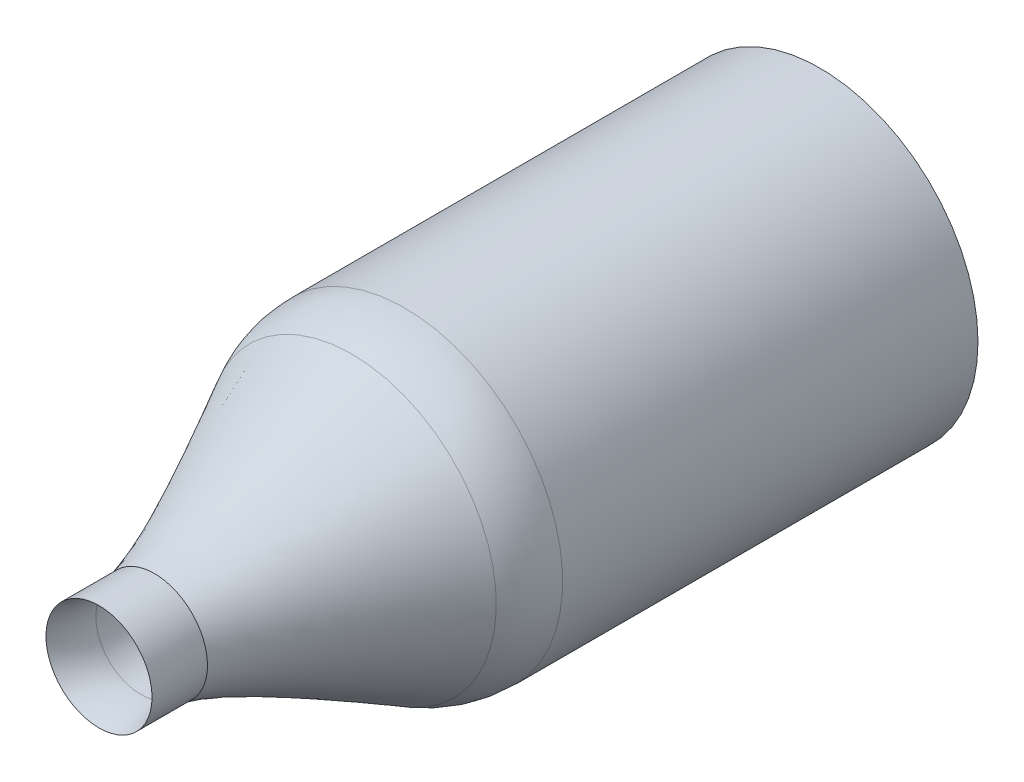
ISO-10303-21;
HEADER;
FILE_DESCRIPTION(('STEP AP214'),'2;1');
FILE_NAME('part.step','',(''),(''),'','','');
FILE_SCHEMA(('AUTOMOTIVE_DESIGN { 1 0 10303 214 1 1 1 1 }'));
ENDSEC;
DATA;
#1=APPLICATION_CONTEXT('core data for automotive mechanical design processes');
#2=APPLICATION_PROTOCOL_DEFINITION('international standard','automotive_design',2000,#1);
#3=PRODUCT_CONTEXT('',#1,'mechanical');
#4=PRODUCT('Part','Part','',(#3));
#5=PRODUCT_RELATED_PRODUCT_CATEGORY('part','',(#4));
#6=PRODUCT_DEFINITION_FORMATION('','',#4);
#7=PRODUCT_DEFINITION_CONTEXT('part definition',#1,'design');
#8=PRODUCT_DEFINITION('design','',#6,#7);
#9=PRODUCT_DEFINITION_SHAPE('','',#8);
#10=(LENGTH_UNIT() NAMED_UNIT(*) SI_UNIT(.MILLI.,.METRE.));
#11=(NAMED_UNIT(*) PLANE_ANGLE_UNIT() SI_UNIT($,.RADIAN.));
#12=(NAMED_UNIT(*) SI_UNIT($,.STERADIAN.) SOLID_ANGLE_UNIT());
#13=UNCERTAINTY_MEASURE_WITH_UNIT(LENGTH_MEASURE(1.E-05),#10,'distance_accuracy_value','');
#14=(GEOMETRIC_REPRESENTATION_CONTEXT(3) GLOBAL_UNCERTAINTY_ASSIGNED_CONTEXT((#13)) GLOBAL_UNIT_ASSIGNED_CONTEXT((#10,
#11,#12)) REPRESENTATION_CONTEXT('',''));
#15=CARTESIAN_POINT('',(0.,0.,0.));
#16=DIRECTION('',(0.,0.,1.));
#17=DIRECTION('',(1.,0.,0.));
#18=AXIS2_PLACEMENT_3D('',#15,#16,#17);
#19=CARTESIAN_POINT('',(0.,0.,40.));
#20=DIRECTION('',(0.,0.,-1.));
#21=DIRECTION('',(-1.,0.,0.));
#22=AXIS2_PLACEMENT_3D('',#19,#20,#21);
#23=CYLINDRICAL_SURFACE('',#22,14.25);
#24=CARTESIAN_POINT('',(0.,0.,37.4484601497036));
#25=DIRECTION('',(0.,0.,-1.));
#26=DIRECTION('',(-1.,0.,0.));
#27=AXIS2_PLACEMENT_3D('',#24,#25,#26);
#28=CIRCLE('',#27,14.25);
#29=CARTESIAN_POINT('',(-14.25,0.,37.4484601497036));
#30=VERTEX_POINT('',#29);
#31=EDGE_CURVE('E63',#30,#30,#28,.T.);
#32=ORIENTED_EDGE('',*,*,#31,.T.);
#33=EDGE_LOOP('',(#32));
#34=FACE_BOUND('',#33,.T.);
#35=CARTESIAN_POINT('',(0.,0.,0.));
#36=DIRECTION('',(0.,0.,1.));
#37=DIRECTION('',(1.,0.,0.));
#38=AXIS2_PLACEMENT_3D('',#35,#36,#37);
#39=CIRCLE('',#38,14.25);
#40=CARTESIAN_POINT('',(14.25,0.,0.));
#41=VERTEX_POINT('',#40);
#42=EDGE_CURVE('E73',#41,#41,#39,.T.);
#43=ORIENTED_EDGE('',*,*,#42,.T.);
#44=EDGE_LOOP('',(#43));
#45=FACE_BOUND('',#44,.T.);
#46=ADVANCED_FACE('F45',(#34,#45),#23,.T.);
#47=CARTESIAN_POINT('',(0.,0.,40.));
#48=DIRECTION('',(0.,0.,-1.));
#49=DIRECTION('',(-1.,0.,0.));
#50=AXIS2_PLACEMENT_3D('',#47,#48,#49);
#51=CYLINDRICAL_SURFACE('',#50,13.75);
#52=CARTESIAN_POINT('',(0.,0.,3.1224989991992));
#53=DIRECTION('',(0.,0.,-1.));
#54=DIRECTION('',(-1.,0.,0.));
#55=AXIS2_PLACEMENT_3D('',#52,#53,#54);
#56=CIRCLE('',#55,13.75);
#57=CARTESIAN_POINT('',(-13.75,0.,3.1224989991992));
#58=VERTEX_POINT('',#57);
#59=EDGE_CURVE('E11',#58,#58,#56,.T.);
#60=ORIENTED_EDGE('',*,*,#59,.T.);
#61=EDGE_LOOP('',(#60));
#62=FACE_BOUND('',#61,.T.);
#63=CARTESIAN_POINT('',(0.,0.,40.));
#64=DIRECTION('',(0.,0.,1.));
#65=DIRECTION('',(1.,0.,0.));
#66=AXIS2_PLACEMENT_3D('',#63,#64,#65);
#67=CIRCLE('',#66,13.75);
#68=CARTESIAN_POINT('',(13.75,0.,40.));
#69=VERTEX_POINT('',#68);
#70=EDGE_CURVE('E79',#69,#69,#67,.T.);
#71=ORIENTED_EDGE('',*,*,#70,.T.);
#72=EDGE_LOOP('',(#71));
#73=FACE_BOUND('',#72,.T.);
#74=ADVANCED_FACE('F118',(#62,#73),#51,.F.);
#75=CARTESIAN_POINT('',(-8.03928399935637,11.7657304396154,40.));
#76=CARTESIAN_POINT('',(-4.72188129185086,0.747872525688698,60.));
#77=CARTESIAN_POINT('',(-31.5707448785872,-4.31283755909735,40.));
#78=CARTESIAN_POINT('',(-6.21762634322826,-8.69589005801302,60.));
#79=CARTESIAN_POINT('',(-15.4921768798744,-27.8442984383282,40.));
#80=CARTESIAN_POINT('',(3.22613624047346,-10.1916351093904,60.));
#81=CARTESIAN_POINT('',(8.03928399935638,-11.7657304396154,40.));
#82=CARTESIAN_POINT('',(4.72188129185086,-0.747872525688703,60.));
#83=CARTESIAN_POINT('',(31.5707448785872,4.31283755909735,40.));
#84=CARTESIAN_POINT('',(6.21762634322827,8.69589005801302,60.));
#85=CARTESIAN_POINT('',(15.4921768798744,27.8442984383282,40.));
#86=CARTESIAN_POINT('',(-3.22613624047346,10.1916351093904,60.));
#87=CARTESIAN_POINT('',(-8.03928399935637,11.7657304396154,40.));
#88=CARTESIAN_POINT('',(-4.72188129185086,0.747872525688698,60.));
#89=(BOUNDED_SURFACE() B_SPLINE_SURFACE(3,1,((#75,#76),(#77,#78),(#79,#80),(#81,#82),(#83,#84),
(#85,#86),(#87,#88)),.UNSPECIFIED.,.T.,.F.,.F.) B_SPLINE_SURFACE_WITH_KNOTS((4,3,4),(2,2),(0.,
0.5,1.),(0.,1.),.UNSPECIFIED.) GEOMETRIC_REPRESENTATION_ITEM() RATIONAL_B_SPLINE_SURFACE(((1.,
1.),(0.333333333333333,0.333333333333334),(0.333333333333333,0.333333333333334),(1.,1.),
(0.333333333333333,0.333333333333333),(0.333333333333333,0.333333333333333),(1.,1.))) REPRESENTATION_ITEM('') SURFACE());
#90=CARTESIAN_POINT('',(0.,0.,42.2206396391398));
#91=DIRECTION('',(0.,0.,1.));
#92=DIRECTION('',(1.,0.,0.));
#93=AXIS2_PLACEMENT_3D('',#90,#91,#92);
#94=CIRCLE('',#93,13.0378497324774);
#95=CARTESIAN_POINT('',(-7.67094620179255,10.5423958385116,42.2206396391398));
#96=VERTEX_POINT('',#95);
#97=EDGE_CURVE('E69',#96,#96,#94,.T.);
#98=CARTESIAN_POINT('',(0.,0.,60.));
#99=DIRECTION('',(0.,0.,1.));
#100=DIRECTION('',(1.,0.,0.));
#101=AXIS2_PLACEMENT_3D('',#98,#99,#100);
#102=CIRCLE('',#101,4.7807401361098);
#103=CARTESIAN_POINT('',(-4.72188129185086,0.747872525688698,60.));
#104=VERTEX_POINT('',#103);
#105=EDGE_CURVE('E74',#104,#104,#102,.T.);
#106=CARTESIAN_POINT('',(-7.67094620179255,10.5423958385116,42.2206396391398));
#107=CARTESIAN_POINT('',(-7.64022677564732,10.440369554003,42.4058413095655));
#108=CARTESIAN_POINT('',(-7.60950734950209,10.3383432694945,42.5910429799911));
#109=CARTESIAN_POINT('',(-7.54806849721164,10.1342907004773,42.9614463208424));
#110=CARTESIAN_POINT('',(-7.51734907106642,10.0322644159687,43.146647991268));
#111=CARTESIAN_POINT('',(-7.45591021877596,9.82821184695159,43.5170513321192));
#112=CARTESIAN_POINT('',(-7.42519079263074,9.72618556244302,43.7022530025449));
#113=CARTESIAN_POINT('',(-7.36375194034029,9.52213299342587,44.0726563433961));
#114=CARTESIAN_POINT('',(-7.33303251419506,9.4201067089173,44.2578580138217));
#115=CARTESIAN_POINT('',(-7.27159366190461,9.21605413990016,44.628261354673));
#116=CARTESIAN_POINT('',(-7.24087423575938,9.11402785539159,44.8134630250986));
#117=CARTESIAN_POINT('',(-7.17943538346893,8.90997528637444,45.1838663659499));
#118=CARTESIAN_POINT('',(-7.14871595732371,8.80794900186587,45.3690680363755));
#119=CARTESIAN_POINT('',(-7.08727710503325,8.60389643284872,45.7394713772268));
#120=CARTESIAN_POINT('',(-7.05655767888803,8.50187014834015,45.9246730476524));
#121=CARTESIAN_POINT('',(-6.99511882659758,8.29781757932301,46.2950763885036));
#122=CARTESIAN_POINT('',(-6.96439940045235,8.19579129481444,46.4802780589293));
#123=CARTESIAN_POINT('',(-6.9029605481619,7.9917387257973,46.8506813997805));
#124=CARTESIAN_POINT('',(-6.87224112201667,7.88971244128872,47.0358830702061));
#125=CARTESIAN_POINT('',(-6.81080226972622,7.68565987227158,47.4062864110574));
#126=CARTESIAN_POINT('',(-6.780082843581,7.58363358776301,47.591488081483));
#127=CARTESIAN_POINT('',(-6.71864399129054,7.37958101874587,47.9618914223343));
#128=CARTESIAN_POINT('',(-6.68792456514532,7.27755473423729,48.1470930927599));
#129=CARTESIAN_POINT('',(-6.62648571285487,7.07350216522015,48.5174964336112));
#130=CARTESIAN_POINT('',(-6.59576628670964,6.97147588071158,48.7026981040368));
#131=CARTESIAN_POINT('',(-6.53432743441919,6.76742331169443,49.073101444888));
#132=CARTESIAN_POINT('',(-6.50360800827396,6.66539702718586,49.2583031153137));
#133=CARTESIAN_POINT('',(-6.44216915598351,6.46134445816872,49.6287064561649));
#134=CARTESIAN_POINT('',(-6.41144972983828,6.35931817366014,49.8139081265905));
#135=CARTESIAN_POINT('',(-6.35001087754783,6.155265604643,50.1843114674418));
#136=CARTESIAN_POINT('',(-6.31929145140261,6.05323932013443,50.3695131378674));
#137=CARTESIAN_POINT('',(-6.25785259911216,5.84918675111729,50.7399164787187));
#138=CARTESIAN_POINT('',(-6.22713317296693,5.74716046660872,50.9251181491443));
#139=CARTESIAN_POINT('',(-6.16569432067648,5.54310789759157,51.2955214899956));
#140=CARTESIAN_POINT('',(-6.13497489453125,5.441081613083,51.4807231604212));
#141=CARTESIAN_POINT('',(-6.0735360422408,5.23702904406586,51.8511265012724));
#142=CARTESIAN_POINT('',(-6.04281661609557,5.13500275955728,52.0363281716981));
#143=CARTESIAN_POINT('',(-5.98137776380512,4.93095019054014,52.4067315125493));
#144=CARTESIAN_POINT('',(-5.9506583376599,4.82892390603157,52.5919331829749));
#145=CARTESIAN_POINT('',(-5.88921948536944,4.62487133701443,52.9623365238262));
#146=CARTESIAN_POINT('',(-5.85850005922422,4.52284505250586,53.1475381942518));
#147=CARTESIAN_POINT('',(-5.79706120693377,4.31879248348871,53.5179415351031));
#148=CARTESIAN_POINT('',(-5.76634178078854,4.21676619898014,53.7031432055287));
#149=CARTESIAN_POINT('',(-5.70490292849809,4.012713629963,54.0735465463799));
#150=CARTESIAN_POINT('',(-5.67418350235286,3.91068734545442,54.2587482168056));
#151=CARTESIAN_POINT('',(-5.61274465006241,3.70663477643728,54.6291515576568));
#152=CARTESIAN_POINT('',(-5.58202522391719,3.60460849192871,54.8143532280825));
#153=CARTESIAN_POINT('',(-5.52058637162673,3.40055592291156,55.1847565689337));
#154=CARTESIAN_POINT('',(-5.48986694548151,3.29852963840299,55.3699582393593));
#155=CARTESIAN_POINT('',(-5.42842809319106,3.09447706938585,55.7403615802106));
#156=CARTESIAN_POINT('',(-5.39770866704583,2.99245078487728,55.9255632506362));
#157=CARTESIAN_POINT('',(-5.33626981475538,2.78839821586013,56.2959665914875));
#158=CARTESIAN_POINT('',(-5.30555038861015,2.68637193135156,56.4811682619131));
#159=CARTESIAN_POINT('',(-5.2441115363197,2.48231936233442,56.8515716027644));
#160=CARTESIAN_POINT('',(-5.21339211017448,2.38029307782585,57.03677327319));
#161=CARTESIAN_POINT('',(-5.15195325788403,2.1762405088087,57.4071766140412));
#162=CARTESIAN_POINT('',(-5.1212338317388,2.07421422430013,57.5923782844669));
#163=CARTESIAN_POINT('',(-5.05979497944835,1.87016165528299,57.9627816253181));
#164=CARTESIAN_POINT('',(-5.02907555330312,1.76813537077442,58.1479832957437));
#165=CARTESIAN_POINT('',(-4.96763670101267,1.56408280175727,58.518386636595));
#166=CARTESIAN_POINT('',(-4.93691727486744,1.4620565172487,58.7035883070206));
#167=CARTESIAN_POINT('',(-4.87547842257699,1.25800394823156,59.0739916478719));
#168=CARTESIAN_POINT('',(-4.84475899643177,1.15597766372299,59.2591933182975));
#169=CARTESIAN_POINT('',(-4.78332014414131,0.951925094705841,59.6295966591487));
#170=CARTESIAN_POINT('',(-4.75260071799609,0.849898810197269,59.8147983295744));
#171=CARTESIAN_POINT('',(-4.72188129185086,0.747872525688698,60.));
#172=B_SPLINE_CURVE_WITH_KNOTS('',3,(#106,#107,#108,#109,#110,#111,#112,#113,#114,#115,#116,
#117,#118,#119,#120,#121,#122,#123,#124,#125,#126,#127,#128,#129,#130,#131,#132,#133,#134,#135,
#136,#137,#138,#139,#140,#141,#142,#143,#144,#145,#146,#147,#148,#149,#150,#151,#152,#153,#154,
#155,#156,#157,#158,#159,#160,#161,#162,#163,#164,#165,#166,#167,#168,#169,#170,#171),
.UNSPECIFIED.,.F.,.F.,(4,2,2,2,2,2,2,2,2,2,2,2,2,2,2,2,2,2,2,2,2,2,2,2,2,2,2,2,2,2,2,2,4),(0.,
0.640994806075554,1.2819896121511,1.92298441822664,2.56397922430219,3.20497403037773,
3.84596883645328,4.48696364252882,5.12795844860437,5.76895325467991,6.40994806075546,
7.050942866831,7.69193767290655,8.33293247898209,8.97392728505764,9.61492209113318,
10.2559168972087,10.8969117032843,11.5379065093598,12.1789013154354,12.8198961215109,
13.4608909275864,14.101885733662,14.7428805397376,15.3838753458131,16.0248701518886,
16.6658649579642,17.3068597640397,17.9478545701153,18.5888493761908,19.2298441822664,
19.8708389883419,20.5118337944175),.UNSPECIFIED.);
#173=EDGE_CURVE('BSEAM101',#96,#104,#172,.T.);
#174=ORIENTED_EDGE('',*,*,#97,.T.);
#175=ORIENTED_EDGE('',*,*,#105,.F.);
#176=ORIENTED_EDGE('',*,*,#173,.T.);
#177=ORIENTED_EDGE('',*,*,#173,.F.);
#178=EDGE_LOOP('',(#174,#176,#175,#177));
#179=FACE_BOUND('',#178,.T.);
#180=ADVANCED_FACE('F101',(#179),#89,.T.);
#181=CARTESIAN_POINT('',(0.,0.,65.));
#182=DIRECTION('',(0.,0.,-1.));
#183=DIRECTION('',(-1.,0.,0.));
#184=AXIS2_PLACEMENT_3D('',#181,#182,#183);
#185=CYLINDRICAL_SURFACE('',#184,4.7807401361098);
#186=CARTESIAN_POINT('',(0.,0.,65.));
#187=DIRECTION('',(0.,0.,1.));
#188=DIRECTION('',(1.,0.,0.));
#189=AXIS2_PLACEMENT_3D('',#186,#187,#188);
#190=CIRCLE('',#189,4.7807401361098);
#191=CARTESIAN_POINT('',(4.7807401361098,0.,65.));
#192=VERTEX_POINT('',#191);
#193=EDGE_CURVE('E80',#192,#192,#190,.T.);
#194=ORIENTED_EDGE('',*,*,#193,.F.);
#195=EDGE_LOOP('',(#194));
#196=FACE_BOUND('',#195,.T.);
#197=ORIENTED_EDGE('',*,*,#105,.T.);
#198=EDGE_LOOP('',(#197));
#199=FACE_BOUND('',#198,.T.);
#200=ADVANCED_FACE('F99',(#196,#199),#185,.T.);
#201=CARTESIAN_POINT('',(0.,0.,22.));
#202=DIRECTION('',(0.,0.,1.));
#203=DIRECTION('',(1.,0.,0.));
#204=AXIS2_PLACEMENT_3D('',#201,#202,#203);
#205=CYLINDRICAL_SURFACE('',#204,4.04530413049165);
#206=CARTESIAN_POINT('',(0.,0.,61.2359790125448));
#207=DIRECTION('',(0.,0.,1.));
#208=DIRECTION('',(1.,0.,0.));
#209=AXIS2_PLACEMENT_3D('',#206,#207,#208);
#210=CIRCLE('',#209,4.04530413049165);
#211=CARTESIAN_POINT('',(4.04530413049165,0.,61.2359790125448));
#212=VERTEX_POINT('',#211);
#213=EDGE_CURVE('E53',#212,#212,#210,.T.);
#214=ORIENTED_EDGE('',*,*,#213,.T.);
#215=EDGE_LOOP('',(#214));
#216=FACE_BOUND('',#215,.T.);
#217=CARTESIAN_POINT('',(0.,0.,49.9956388225323));
#218=DIRECTION('',(0.,0.,-1.));
#219=DIRECTION('',(-1.,0.,0.));
#220=AXIS2_PLACEMENT_3D('',#217,#218,#219);
#221=CIRCLE('',#220,4.04530413049165);
#222=CARTESIAN_POINT('',(-4.04530413049165,0.,49.9956388225323));
#223=VERTEX_POINT('',#222);
#224=EDGE_CURVE('E58',#223,#223,#221,.T.);
#225=ORIENTED_EDGE('',*,*,#224,.T.);
#226=EDGE_LOOP('',(#225));
#227=FACE_BOUND('',#226,.T.);
#228=ADVANCED_FACE('F111',(#216,#227),#205,.F.);
#229=CARTESIAN_POINT('',(0.,0.,37.4484601497036));
#230=DIRECTION('',(0.,0.,-1.));
#231=DIRECTION('',(-1.,0.,0.));
#232=AXIS2_PLACEMENT_3D('',#229,#230,#231);
#233=DEGENERATE_TOROIDAL_SURFACE('',#232,4.25,10.,.T.);
#234=ORIENTED_EDGE('',*,*,#31,.F.);
#235=EDGE_LOOP('',(#234));
#236=FACE_BOUND('',#235,.T.);
#237=ORIENTED_EDGE('',*,*,#97,.F.);
#238=EDGE_LOOP('',(#237));
#239=FACE_BOUND('',#238,.T.);
#240=ADVANCED_FACE('F116',(#236,#239),#233,.T.);
#241=CARTESIAN_POINT('',(0.,0.,49.9956388225323));
#242=DIRECTION('',(0.,0.,-1.));
#243=DIRECTION('',(-1.,0.,0.));
#244=AXIS2_PLACEMENT_3D('',#241,#242,#243);
#245=TOROIDAL_SURFACE('',#244,14.0453041304917,10.);
#246=ORIENTED_EDGE('',*,*,#224,.F.);
#247=EDGE_LOOP('',(#246));
#248=FACE_BOUND('',#247,.T.);
#249=ORIENTED_EDGE('',*,*,#70,.F.);
#250=EDGE_LOOP('',(#249));
#251=FACE_BOUND('',#250,.T.);
#252=ADVANCED_FACE('F132',(#248,#251),#245,.T.);
#253=CARTESIAN_POINT('',(0.,0.,61.2359790125448));
#254=DIRECTION('',(0.,0.,1.));
#255=DIRECTION('',(1.,0.,0.));
#256=AXIS2_PLACEMENT_3D('',#253,#254,#255);
#257=TOROIDAL_SURFACE('',#256,14.0453041304917,10.);
#258=ORIENTED_EDGE('',*,*,#193,.T.);
#259=EDGE_LOOP('',(#258));
#260=FACE_BOUND('',#259,.T.);
#261=ORIENTED_EDGE('',*,*,#213,.F.);
#262=EDGE_LOOP('',(#261));
#263=FACE_BOUND('',#262,.T.);
#264=ADVANCED_FACE('F107',(#260,#263),#257,.T.);
#265=CARTESIAN_POINT('',(0.,0.,3.1224989991992));
#266=DIRECTION('',(0.,0.,-1.));
#267=DIRECTION('',(-1.,0.,0.));
#268=AXIS2_PLACEMENT_3D('',#265,#266,#267);
#269=TOROIDAL_SURFACE('',#268,23.75,10.);
#270=ORIENTED_EDGE('',*,*,#59,.F.);
#271=EDGE_LOOP('',(#270));
#272=FACE_BOUND('',#271,.T.);
#273=ORIENTED_EDGE('',*,*,#42,.F.);
#274=EDGE_LOOP('',(#273));
#275=FACE_BOUND('',#274,.T.);
#276=ADVANCED_FACE('F47',(#272,#275),#269,.T.);
#277=CLOSED_SHELL('',(#46,#74,#180,#200,#228,#240,#252,#264,#276));
#278=MANIFOLD_SOLID_BREP('B2',#277);
#279=ADVANCED_BREP_SHAPE_REPRESENTATION('',(#18,#278),#14);
#280=SHAPE_DEFINITION_REPRESENTATION(#9,#279);
ENDSEC;
END-ISO-10303-21;
